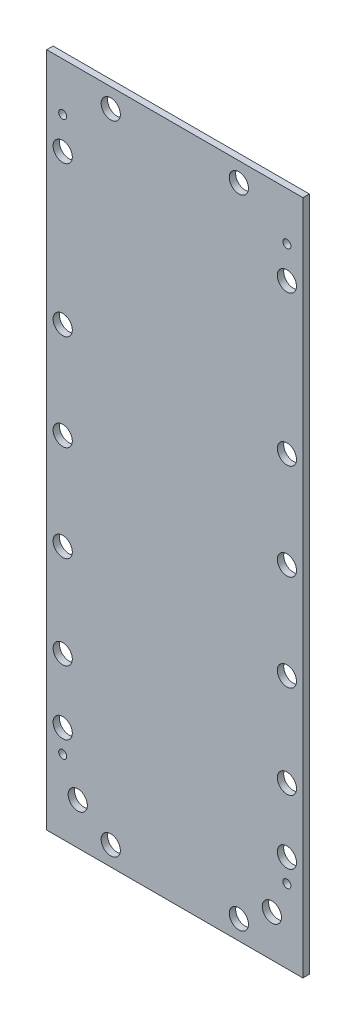
ISO-10303-21;
HEADER;
FILE_DESCRIPTION(('STEP AP214'),'2;1');
FILE_NAME('part.step','',(''),(''),'','','');
FILE_SCHEMA(('AUTOMOTIVE_DESIGN { 1 0 10303 214 1 1 1 1 }'));
ENDSEC;
DATA;
#1=APPLICATION_CONTEXT('core data for automotive mechanical design processes');
#2=APPLICATION_PROTOCOL_DEFINITION('international standard','automotive_design',2000,#1);
#3=PRODUCT_CONTEXT('',#1,'mechanical');
#4=PRODUCT('Part','Part','',(#3));
#5=PRODUCT_RELATED_PRODUCT_CATEGORY('part','',(#4));
#6=PRODUCT_DEFINITION_FORMATION('','',#4);
#7=PRODUCT_DEFINITION_CONTEXT('part definition',#1,'design');
#8=PRODUCT_DEFINITION('design','',#6,#7);
#9=PRODUCT_DEFINITION_SHAPE('','',#8);
#10=(LENGTH_UNIT() NAMED_UNIT(*) SI_UNIT(.MILLI.,.METRE.));
#11=(NAMED_UNIT(*) PLANE_ANGLE_UNIT() SI_UNIT($,.RADIAN.));
#12=(NAMED_UNIT(*) SI_UNIT($,.STERADIAN.) SOLID_ANGLE_UNIT());
#13=UNCERTAINTY_MEASURE_WITH_UNIT(LENGTH_MEASURE(1.E-05),#10,'distance_accuracy_value','');
#14=(GEOMETRIC_REPRESENTATION_CONTEXT(3) GLOBAL_UNCERTAINTY_ASSIGNED_CONTEXT((#13)) GLOBAL_UNIT_ASSIGNED_CONTEXT((#10,
#11,#12)) REPRESENTATION_CONTEXT('',''));
#15=CARTESIAN_POINT('',(0.,0.,0.));
#16=DIRECTION('',(0.,0.,1.));
#17=DIRECTION('',(1.,0.,0.));
#18=AXIS2_PLACEMENT_3D('',#15,#16,#17);
#19=CARTESIAN_POINT('',(80.,0.,2.));
#20=DIRECTION('',(0.,1.,0.));
#21=DIRECTION('',(0.,0.,1.));
#22=AXIS2_PLACEMENT_3D('',#19,#20,#21);
#23=PLANE('',#22);
#24=DIRECTION('',(1.,0.,0.));
#25=VECTOR('',#24,1.);
#26=CARTESIAN_POINT('',(80.,0.,0.));
#27=LINE('',#26,#25);
#28=CARTESIAN_POINT('',(0.,0.,0.));
#29=VERTEX_POINT('',#28);
#30=CARTESIAN_POINT('',(80.,0.,0.));
#31=VERTEX_POINT('',#30);
#32=EDGE_CURVE('E104',#29,#31,#27,.T.);
#33=ORIENTED_EDGE('',*,*,#32,.T.);
#34=DIRECTION('',(0.,0.,-1.));
#35=VECTOR('',#34,1.);
#36=CARTESIAN_POINT('',(80.,0.,2.));
#37=LINE('',#36,#35);
#38=CARTESIAN_POINT('',(80.,0.,2.));
#39=VERTEX_POINT('',#38);
#40=EDGE_CURVE('E11',#39,#31,#37,.T.);
#41=ORIENTED_EDGE('',*,*,#40,.F.);
#42=DIRECTION('',(1.,0.,0.));
#43=VECTOR('',#42,1.);
#44=CARTESIAN_POINT('',(80.,0.,2.));
#45=LINE('',#44,#43);
#46=CARTESIAN_POINT('',(0.,0.,2.));
#47=VERTEX_POINT('',#46);
#48=EDGE_CURVE('E91',#47,#39,#45,.T.);
#49=ORIENTED_EDGE('',*,*,#48,.F.);
#50=DIRECTION('',(0.,0.,-1.));
#51=VECTOR('',#50,1.);
#52=CARTESIAN_POINT('',(0.,0.,2.));
#53=LINE('',#52,#51);
#54=EDGE_CURVE('E100',#47,#29,#53,.T.);
#55=ORIENTED_EDGE('',*,*,#54,.T.);
#56=EDGE_LOOP('',(#33,#41,#49,#55));
#57=FACE_BOUND('',#56,.T.);
#58=ADVANCED_FACE('F38',(#57),#23,.F.);
#59=CARTESIAN_POINT('',(80.,211.,2.));
#60=DIRECTION('',(-1.,0.,0.));
#61=DIRECTION('',(0.,0.,1.));
#62=AXIS2_PLACEMENT_3D('',#59,#60,#61);
#63=PLANE('',#62);
#64=DIRECTION('',(0.,1.,0.));
#65=VECTOR('',#64,1.);
#66=CARTESIAN_POINT('',(80.,211.,0.));
#67=LINE('',#66,#65);
#68=CARTESIAN_POINT('',(80.,211.,0.));
#69=VERTEX_POINT('',#68);
#70=EDGE_CURVE('E95',#31,#69,#67,.T.);
#71=ORIENTED_EDGE('',*,*,#70,.T.);
#72=DIRECTION('',(0.,0.,-1.));
#73=VECTOR('',#72,1.);
#74=CARTESIAN_POINT('',(80.,211.,2.));
#75=LINE('',#74,#73);
#76=CARTESIAN_POINT('',(80.,211.,2.));
#77=VERTEX_POINT('',#76);
#78=EDGE_CURVE('E47',#77,#69,#75,.T.);
#79=ORIENTED_EDGE('',*,*,#78,.F.);
#80=DIRECTION('',(0.,1.,0.));
#81=VECTOR('',#80,1.);
#82=CARTESIAN_POINT('',(80.,211.,2.));
#83=LINE('',#82,#81);
#84=EDGE_CURVE('E86',#39,#77,#83,.T.);
#85=ORIENTED_EDGE('',*,*,#84,.F.);
#86=ORIENTED_EDGE('',*,*,#40,.T.);
#87=EDGE_LOOP('',(#71,#79,#85,#86));
#88=FACE_BOUND('',#87,.T.);
#89=ADVANCED_FACE('F94',(#88),#63,.F.);
#90=CARTESIAN_POINT('',(0.,211.,2.));
#91=DIRECTION('',(0.,-1.,0.));
#92=DIRECTION('',(0.,0.,-1.));
#93=AXIS2_PLACEMENT_3D('',#90,#91,#92);
#94=PLANE('',#93);
#95=DIRECTION('',(-1.,0.,0.));
#96=VECTOR('',#95,1.);
#97=CARTESIAN_POINT('',(0.,211.,0.));
#98=LINE('',#97,#96);
#99=CARTESIAN_POINT('',(0.,211.,0.));
#100=VERTEX_POINT('',#99);
#101=EDGE_CURVE('E73',#69,#100,#98,.T.);
#102=ORIENTED_EDGE('',*,*,#101,.T.);
#103=DIRECTION('',(0.,0.,-1.));
#104=VECTOR('',#103,1.);
#105=CARTESIAN_POINT('',(0.,211.,2.));
#106=LINE('',#105,#104);
#107=CARTESIAN_POINT('',(0.,211.,2.));
#108=VERTEX_POINT('',#107);
#109=EDGE_CURVE('E96',#108,#100,#106,.T.);
#110=ORIENTED_EDGE('',*,*,#109,.F.);
#111=DIRECTION('',(-1.,0.,0.));
#112=VECTOR('',#111,1.);
#113=CARTESIAN_POINT('',(0.,211.,2.));
#114=LINE('',#113,#112);
#115=EDGE_CURVE('E89',#77,#108,#114,.T.);
#116=ORIENTED_EDGE('',*,*,#115,.F.);
#117=ORIENTED_EDGE('',*,*,#78,.T.);
#118=EDGE_LOOP('',(#102,#110,#116,#117));
#119=FACE_BOUND('',#118,.T.);
#120=ADVANCED_FACE('F98',(#119),#94,.F.);
#121=CARTESIAN_POINT('',(0.,0.,2.));
#122=DIRECTION('',(1.,0.,0.));
#123=DIRECTION('',(0.,0.,-1.));
#124=AXIS2_PLACEMENT_3D('',#121,#122,#123);
#125=PLANE('',#124);
#126=DIRECTION('',(0.,-1.,0.));
#127=VECTOR('',#126,1.);
#128=CARTESIAN_POINT('',(0.,0.,0.));
#129=LINE('',#128,#127);
#130=EDGE_CURVE('E79',#100,#29,#129,.T.);
#131=ORIENTED_EDGE('',*,*,#130,.T.);
#132=ORIENTED_EDGE('',*,*,#54,.F.);
#133=DIRECTION('',(0.,-1.,0.));
#134=VECTOR('',#133,1.);
#135=CARTESIAN_POINT('',(0.,0.,2.));
#136=LINE('',#135,#134);
#137=EDGE_CURVE('E56',#108,#47,#136,.T.);
#138=ORIENTED_EDGE('',*,*,#137,.F.);
#139=ORIENTED_EDGE('',*,*,#109,.T.);
#140=EDGE_LOOP('',(#131,#132,#138,#139));
#141=FACE_BOUND('',#140,.T.);
#142=ADVANCED_FACE('F156',(#141),#125,.F.);
#143=CARTESIAN_POINT('',(0.,0.,2.));
#144=DIRECTION('',(0.,0.,-1.));
#145=DIRECTION('',(-1.,0.,0.));
#146=AXIS2_PLACEMENT_3D('',#143,#144,#145);
#147=PLANE('',#146);
#148=CARTESIAN_POINT('',(20.,205.,2.));
#149=DIRECTION('',(0.,0.,-1.));
#150=DIRECTION('',(-1.,0.,0.));
#151=AXIS2_PLACEMENT_3D('',#148,#149,#150);
#152=CIRCLE('',#151,3.);
#153=CARTESIAN_POINT('',(17.,205.,2.));
#154=VERTEX_POINT('',#153);
#155=EDGE_CURVE('E407',#154,#154,#152,.F.);
#156=ORIENTED_EDGE('',*,*,#155,.F.);
#157=EDGE_LOOP('',(#156));
#158=FACE_BOUND('',#157,.T.);
#159=CARTESIAN_POINT('',(5.00000000000001,30.2,2.));
#160=DIRECTION('',(0.,0.,-1.));
#161=DIRECTION('',(-1.,0.,0.));
#162=AXIS2_PLACEMENT_3D('',#159,#160,#161);
#163=CIRCLE('',#162,3.);
#164=CARTESIAN_POINT('',(2.00000000000001,30.2,2.));
#165=VERTEX_POINT('',#164);
#166=EDGE_CURVE('E419',#165,#165,#163,.F.);
#167=ORIENTED_EDGE('',*,*,#166,.F.);
#168=EDGE_LOOP('',(#167));
#169=FACE_BOUND('',#168,.T.);
#170=CARTESIAN_POINT('',(5.00000000000001,50.2,2.));
#171=DIRECTION('',(0.,0.,-1.));
#172=DIRECTION('',(-1.,0.,0.));
#173=AXIS2_PLACEMENT_3D('',#170,#171,#172);
#174=CIRCLE('',#173,3.);
#175=CARTESIAN_POINT('',(2.00000000000001,50.2,2.));
#176=VERTEX_POINT('',#175);
#177=EDGE_CURVE('E426',#176,#176,#174,.F.);
#178=ORIENTED_EDGE('',*,*,#177,.F.);
#179=EDGE_LOOP('',(#178));
#180=FACE_BOUND('',#179,.T.);
#181=CARTESIAN_POINT('',(5.00000000000002,79.2,2.));
#182=DIRECTION('',(0.,0.,-1.));
#183=DIRECTION('',(-1.,0.,0.));
#184=AXIS2_PLACEMENT_3D('',#181,#182,#183);
#185=CIRCLE('',#184,3.);
#186=CARTESIAN_POINT('',(2.00000000000001,79.2,2.));
#187=VERTEX_POINT('',#186);
#188=EDGE_CURVE('E425',#187,#187,#185,.F.);
#189=ORIENTED_EDGE('',*,*,#188,.F.);
#190=EDGE_LOOP('',(#189));
#191=FACE_BOUND('',#190,.T.);
#192=CARTESIAN_POINT('',(60.,5.99999999999999,2.));
#193=DIRECTION('',(0.,0.,-1.));
#194=DIRECTION('',(-1.,0.,0.));
#195=AXIS2_PLACEMENT_3D('',#192,#193,#194);
#196=CIRCLE('',#195,3.);
#197=CARTESIAN_POINT('',(57.,5.99999999999999,2.));
#198=VERTEX_POINT('',#197);
#199=EDGE_CURVE('E411',#198,#198,#196,.F.);
#200=ORIENTED_EDGE('',*,*,#199,.F.);
#201=EDGE_LOOP('',(#200));
#202=FACE_BOUND('',#201,.T.);
#203=CARTESIAN_POINT('',(20.,5.99999999999999,2.));
#204=DIRECTION('',(0.,0.,-1.));
#205=DIRECTION('',(-1.,0.,0.));
#206=AXIS2_PLACEMENT_3D('',#203,#204,#205);
#207=CIRCLE('',#206,2.99999999999999);
#208=CARTESIAN_POINT('',(17.,5.99999999999999,2.));
#209=VERTEX_POINT('',#208);
#210=EDGE_CURVE('E535',#209,#209,#207,.F.);
#211=ORIENTED_EDGE('',*,*,#210,.F.);
#212=EDGE_LOOP('',(#211));
#213=FACE_BOUND('',#212,.T.);
#214=CARTESIAN_POINT('',(70.3,13.,2.));
#215=DIRECTION('',(0.,0.,-1.));
#216=DIRECTION('',(-1.,0.,0.));
#217=AXIS2_PLACEMENT_3D('',#214,#215,#216);
#218=CIRCLE('',#217,3.00000000000001);
#219=CARTESIAN_POINT('',(67.3,13.,2.));
#220=VERTEX_POINT('',#219);
#221=EDGE_CURVE('E540',#220,#220,#218,.F.);
#222=ORIENTED_EDGE('',*,*,#221,.F.);
#223=EDGE_LOOP('',(#222));
#224=FACE_BOUND('',#223,.T.);
#225=CARTESIAN_POINT('',(60.,205.,2.));
#226=DIRECTION('',(0.,0.,-1.));
#227=DIRECTION('',(-1.,0.,0.));
#228=AXIS2_PLACEMENT_3D('',#225,#226,#227);
#229=CIRCLE('',#228,3.);
#230=CARTESIAN_POINT('',(57.,205.,2.));
#231=VERTEX_POINT('',#230);
#232=EDGE_CURVE('E529',#231,#231,#229,.F.);
#233=ORIENTED_EDGE('',*,*,#232,.F.);
#234=EDGE_LOOP('',(#233));
#235=FACE_BOUND('',#234,.T.);
#236=CARTESIAN_POINT('',(75.,139.2,2.));
#237=DIRECTION('',(0.,0.,-1.));
#238=DIRECTION('',(-1.,0.,0.));
#239=AXIS2_PLACEMENT_3D('',#236,#237,#238);
#240=CIRCLE('',#239,3.00000000000001);
#241=CARTESIAN_POINT('',(72.,139.2,2.));
#242=VERTEX_POINT('',#241);
#243=EDGE_CURVE('E462',#242,#242,#240,.F.);
#244=ORIENTED_EDGE('',*,*,#243,.F.);
#245=EDGE_LOOP('',(#244));
#246=FACE_BOUND('',#245,.T.);
#247=CARTESIAN_POINT('',(75.,109.2,2.));
#248=DIRECTION('',(0.,0.,-1.));
#249=DIRECTION('',(-1.,0.,0.));
#250=AXIS2_PLACEMENT_3D('',#247,#248,#249);
#251=CIRCLE('',#250,3.00000000000001);
#252=CARTESIAN_POINT('',(72.,109.2,2.));
#253=VERTEX_POINT('',#252);
#254=EDGE_CURVE('E463',#253,#253,#251,.F.);
#255=ORIENTED_EDGE('',*,*,#254,.F.);
#256=EDGE_LOOP('',(#255));
#257=FACE_BOUND('',#256,.T.);
#258=CARTESIAN_POINT('',(75.,79.2,2.));
#259=DIRECTION('',(0.,0.,-1.));
#260=DIRECTION('',(-1.,0.,0.));
#261=AXIS2_PLACEMENT_3D('',#258,#259,#260);
#262=CIRCLE('',#261,3.00000000000001);
#263=CARTESIAN_POINT('',(72.,79.2,2.));
#264=VERTEX_POINT('',#263);
#265=EDGE_CURVE('E470',#264,#264,#262,.F.);
#266=ORIENTED_EDGE('',*,*,#265,.F.);
#267=EDGE_LOOP('',(#266));
#268=FACE_BOUND('',#267,.T.);
#269=CARTESIAN_POINT('',(75.,50.2,2.));
#270=DIRECTION('',(0.,0.,-1.));
#271=DIRECTION('',(-1.,0.,0.));
#272=AXIS2_PLACEMENT_3D('',#269,#270,#271);
#273=CIRCLE('',#272,3.00000000000001);
#274=CARTESIAN_POINT('',(72.,50.2,2.));
#275=VERTEX_POINT('',#274);
#276=EDGE_CURVE('E476',#275,#275,#273,.F.);
#277=ORIENTED_EDGE('',*,*,#276,.F.);
#278=EDGE_LOOP('',(#277));
#279=FACE_BOUND('',#278,.T.);
#280=CARTESIAN_POINT('',(5.00000000000002,109.2,2.));
#281=DIRECTION('',(0.,0.,-1.));
#282=DIRECTION('',(-1.,0.,0.));
#283=AXIS2_PLACEMENT_3D('',#280,#281,#282);
#284=CIRCLE('',#283,3.);
#285=CARTESIAN_POINT('',(2.00000000000002,109.2,2.));
#286=VERTEX_POINT('',#285);
#287=EDGE_CURVE('E439',#286,#286,#284,.F.);
#288=ORIENTED_EDGE('',*,*,#287,.F.);
#289=EDGE_LOOP('',(#288));
#290=FACE_BOUND('',#289,.T.);
#291=CARTESIAN_POINT('',(5.00000000000002,139.2,2.));
#292=DIRECTION('',(0.,0.,-1.));
#293=DIRECTION('',(-1.,0.,0.));
#294=AXIS2_PLACEMENT_3D('',#291,#292,#293);
#295=CIRCLE('',#294,3.);
#296=CARTESIAN_POINT('',(2.00000000000002,139.2,2.));
#297=VERTEX_POINT('',#296);
#298=EDGE_CURVE('E438',#297,#297,#295,.F.);
#299=ORIENTED_EDGE('',*,*,#298,.F.);
#300=EDGE_LOOP('',(#299));
#301=FACE_BOUND('',#300,.T.);
#302=CARTESIAN_POINT('',(5.00000000000003,186.,2.));
#303=DIRECTION('',(0.,0.,-1.));
#304=DIRECTION('',(-1.,0.,0.));
#305=AXIS2_PLACEMENT_3D('',#302,#303,#304);
#306=CIRCLE('',#305,3.);
#307=CARTESIAN_POINT('',(2.00000000000003,186.,2.));
#308=VERTEX_POINT('',#307);
#309=EDGE_CURVE('E451',#308,#308,#306,.F.);
#310=ORIENTED_EDGE('',*,*,#309,.F.);
#311=EDGE_LOOP('',(#310));
#312=FACE_BOUND('',#311,.T.);
#313=CARTESIAN_POINT('',(75.,30.2,2.));
#314=DIRECTION('',(0.,0.,-1.));
#315=DIRECTION('',(-1.,0.,0.));
#316=AXIS2_PLACEMENT_3D('',#313,#314,#315);
#317=CIRCLE('',#316,3.00000000000001);
#318=CARTESIAN_POINT('',(72.,30.2,2.));
#319=VERTEX_POINT('',#318);
#320=EDGE_CURVE('E450',#319,#319,#317,.F.);
#321=ORIENTED_EDGE('',*,*,#320,.F.);
#322=EDGE_LOOP('',(#321));
#323=FACE_BOUND('',#322,.T.);
#324=CARTESIAN_POINT('',(9.7,13.,2.));
#325=DIRECTION('',(0.,0.,-1.));
#326=DIRECTION('',(-1.,0.,0.));
#327=AXIS2_PLACEMENT_3D('',#324,#325,#326);
#328=CIRCLE('',#327,3.);
#329=CARTESIAN_POINT('',(6.7,13.,2.));
#330=VERTEX_POINT('',#329);
#331=EDGE_CURVE('E524',#330,#330,#328,.F.);
#332=ORIENTED_EDGE('',*,*,#331,.F.);
#333=EDGE_LOOP('',(#332));
#334=FACE_BOUND('',#333,.T.);
#335=CARTESIAN_POINT('',(75.,186.,2.));
#336=DIRECTION('',(0.,0.,-1.));
#337=DIRECTION('',(-1.,0.,0.));
#338=AXIS2_PLACEMENT_3D('',#335,#336,#337);
#339=CIRCLE('',#338,3.00000000000001);
#340=CARTESIAN_POINT('',(72.,186.,2.));
#341=VERTEX_POINT('',#340);
#342=EDGE_CURVE('E485',#341,#341,#339,.F.);
#343=ORIENTED_EDGE('',*,*,#342,.F.);
#344=EDGE_LOOP('',(#343));
#345=FACE_BOUND('',#344,.T.);
#346=CARTESIAN_POINT('',(75.,196.,2.));
#347=DIRECTION('',(0.,0.,-1.));
#348=DIRECTION('',(-1.,0.,0.));
#349=AXIS2_PLACEMENT_3D('',#346,#347,#348);
#350=CIRCLE('',#349,1.25);
#351=CARTESIAN_POINT('',(73.75,196.,2.));
#352=VERTEX_POINT('',#351);
#353=EDGE_CURVE('E41',#352,#352,#350,.T.);
#354=ORIENTED_EDGE('',*,*,#353,.T.);
#355=EDGE_LOOP('',(#354));
#356=FACE_BOUND('',#355,.T.);
#357=CARTESIAN_POINT('',(5.00000000000003,196.,2.));
#358=DIRECTION('',(0.,0.,-1.));
#359=DIRECTION('',(-1.,0.,0.));
#360=AXIS2_PLACEMENT_3D('',#357,#358,#359);
#361=CIRCLE('',#360,1.25);
#362=CARTESIAN_POINT('',(3.75000000000003,196.,2.));
#363=VERTEX_POINT('',#362);
#364=EDGE_CURVE('E121',#363,#363,#361,.T.);
#365=ORIENTED_EDGE('',*,*,#364,.T.);
#366=EDGE_LOOP('',(#365));
#367=FACE_BOUND('',#366,.T.);
#368=CARTESIAN_POINT('',(75.,23.,2.));
#369=DIRECTION('',(0.,0.,-1.));
#370=DIRECTION('',(-1.,0.,0.));
#371=AXIS2_PLACEMENT_3D('',#368,#369,#370);
#372=CIRCLE('',#371,1.25);
#373=CARTESIAN_POINT('',(73.75,23.,2.));
#374=VERTEX_POINT('',#373);
#375=EDGE_CURVE('E112',#374,#374,#372,.T.);
#376=ORIENTED_EDGE('',*,*,#375,.T.);
#377=EDGE_LOOP('',(#376));
#378=FACE_BOUND('',#377,.T.);
#379=CARTESIAN_POINT('',(5.00000000000003,23.,2.));
#380=DIRECTION('',(0.,0.,-1.));
#381=DIRECTION('',(-1.,0.,0.));
#382=AXIS2_PLACEMENT_3D('',#379,#380,#381);
#383=CIRCLE('',#382,1.25);
#384=CARTESIAN_POINT('',(3.75000000000003,23.,2.));
#385=VERTEX_POINT('',#384);
#386=EDGE_CURVE('E107',#385,#385,#383,.T.);
#387=ORIENTED_EDGE('',*,*,#386,.T.);
#388=EDGE_LOOP('',(#387));
#389=FACE_BOUND('',#388,.T.);
#390=ORIENTED_EDGE('',*,*,#48,.T.);
#391=ORIENTED_EDGE('',*,*,#84,.T.);
#392=ORIENTED_EDGE('',*,*,#115,.T.);
#393=ORIENTED_EDGE('',*,*,#137,.T.);
#394=EDGE_LOOP('',(#390,#391,#392,#393));
#395=FACE_BOUND('',#394,.T.);
#396=ADVANCED_FACE('F87',(#158,#169,#180,#191,#202,#213,#224,#235,#246,#257,#268,#279,#290,#301,
#312,#323,#334,#345,#356,#367,#378,#389,#395),#147,.F.);
#397=CARTESIAN_POINT('',(0.,0.,0.));
#398=DIRECTION('',(0.,0.,-1.));
#399=DIRECTION('',(-1.,0.,0.));
#400=AXIS2_PLACEMENT_3D('',#397,#398,#399);
#401=PLANE('',#400);
#402=CARTESIAN_POINT('',(20.,205.,0.));
#403=DIRECTION('',(0.,0.,-1.));
#404=DIRECTION('',(-1.,0.,0.));
#405=AXIS2_PLACEMENT_3D('',#402,#403,#404);
#406=CIRCLE('',#405,3.);
#407=CARTESIAN_POINT('',(17.,205.,0.));
#408=VERTEX_POINT('',#407);
#409=EDGE_CURVE('E410',#408,#408,#406,.T.);
#410=ORIENTED_EDGE('',*,*,#409,.F.);
#411=EDGE_LOOP('',(#410));
#412=FACE_BOUND('',#411,.T.);
#413=CARTESIAN_POINT('',(5.00000000000001,30.2,0.));
#414=DIRECTION('',(0.,0.,-1.));
#415=DIRECTION('',(-1.,0.,0.));
#416=AXIS2_PLACEMENT_3D('',#413,#414,#415);
#417=CIRCLE('',#416,3.);
#418=CARTESIAN_POINT('',(2.00000000000001,30.2,0.));
#419=VERTEX_POINT('',#418);
#420=EDGE_CURVE('E413',#419,#419,#417,.T.);
#421=ORIENTED_EDGE('',*,*,#420,.F.);
#422=EDGE_LOOP('',(#421));
#423=FACE_BOUND('',#422,.T.);
#424=CARTESIAN_POINT('',(5.00000000000001,50.2,0.));
#425=DIRECTION('',(0.,0.,-1.));
#426=DIRECTION('',(-1.,0.,0.));
#427=AXIS2_PLACEMENT_3D('',#424,#425,#426);
#428=CIRCLE('',#427,3.);
#429=CARTESIAN_POINT('',(2.00000000000001,50.2,0.));
#430=VERTEX_POINT('',#429);
#431=EDGE_CURVE('E430',#430,#430,#428,.T.);
#432=ORIENTED_EDGE('',*,*,#431,.F.);
#433=EDGE_LOOP('',(#432));
#434=FACE_BOUND('',#433,.T.);
#435=CARTESIAN_POINT('',(5.00000000000002,79.2,0.));
#436=DIRECTION('',(0.,0.,-1.));
#437=DIRECTION('',(-1.,0.,0.));
#438=AXIS2_PLACEMENT_3D('',#435,#436,#437);
#439=CIRCLE('',#438,3.);
#440=CARTESIAN_POINT('',(2.00000000000001,79.2,0.));
#441=VERTEX_POINT('',#440);
#442=EDGE_CURVE('E422',#441,#441,#439,.T.);
#443=ORIENTED_EDGE('',*,*,#442,.F.);
#444=EDGE_LOOP('',(#443));
#445=FACE_BOUND('',#444,.T.);
#446=CARTESIAN_POINT('',(60.,5.99999999999999,0.));
#447=DIRECTION('',(0.,0.,-1.));
#448=DIRECTION('',(-1.,0.,0.));
#449=AXIS2_PLACEMENT_3D('',#446,#447,#448);
#450=CIRCLE('',#449,3.);
#451=CARTESIAN_POINT('',(57.,5.99999999999999,0.));
#452=VERTEX_POINT('',#451);
#453=EDGE_CURVE('E416',#452,#452,#450,.T.);
#454=ORIENTED_EDGE('',*,*,#453,.F.);
#455=EDGE_LOOP('',(#454));
#456=FACE_BOUND('',#455,.T.);
#457=CARTESIAN_POINT('',(20.,5.99999999999999,0.));
#458=DIRECTION('',(0.,0.,-1.));
#459=DIRECTION('',(-1.,0.,0.));
#460=AXIS2_PLACEMENT_3D('',#457,#458,#459);
#461=CIRCLE('',#460,2.99999999999999);
#462=CARTESIAN_POINT('',(17.,5.99999999999999,0.));
#463=VERTEX_POINT('',#462);
#464=EDGE_CURVE('E537',#463,#463,#461,.T.);
#465=ORIENTED_EDGE('',*,*,#464,.F.);
#466=EDGE_LOOP('',(#465));
#467=FACE_BOUND('',#466,.T.);
#468=CARTESIAN_POINT('',(70.3,13.,0.));
#469=DIRECTION('',(0.,0.,-1.));
#470=DIRECTION('',(-1.,0.,0.));
#471=AXIS2_PLACEMENT_3D('',#468,#469,#470);
#472=CIRCLE('',#471,3.00000000000001);
#473=CARTESIAN_POINT('',(67.3,13.,0.));
#474=VERTEX_POINT('',#473);
#475=EDGE_CURVE('E543',#474,#474,#472,.T.);
#476=ORIENTED_EDGE('',*,*,#475,.F.);
#477=EDGE_LOOP('',(#476));
#478=FACE_BOUND('',#477,.T.);
#479=CARTESIAN_POINT('',(60.,205.,0.));
#480=DIRECTION('',(0.,0.,-1.));
#481=DIRECTION('',(-1.,0.,0.));
#482=AXIS2_PLACEMENT_3D('',#479,#480,#481);
#483=CIRCLE('',#482,3.);
#484=CARTESIAN_POINT('',(57.,205.,0.));
#485=VERTEX_POINT('',#484);
#486=EDGE_CURVE('E525',#485,#485,#483,.T.);
#487=ORIENTED_EDGE('',*,*,#486,.F.);
#488=EDGE_LOOP('',(#487));
#489=FACE_BOUND('',#488,.T.);
#490=CARTESIAN_POINT('',(75.,139.2,0.));
#491=DIRECTION('',(0.,0.,-1.));
#492=DIRECTION('',(-1.,0.,0.));
#493=AXIS2_PLACEMENT_3D('',#490,#491,#492);
#494=CIRCLE('',#493,3.00000000000001);
#495=CARTESIAN_POINT('',(72.,139.2,0.));
#496=VERTEX_POINT('',#495);
#497=EDGE_CURVE('E459',#496,#496,#494,.T.);
#498=ORIENTED_EDGE('',*,*,#497,.F.);
#499=EDGE_LOOP('',(#498));
#500=FACE_BOUND('',#499,.T.);
#501=CARTESIAN_POINT('',(75.,109.2,0.));
#502=DIRECTION('',(0.,0.,-1.));
#503=DIRECTION('',(-1.,0.,0.));
#504=AXIS2_PLACEMENT_3D('',#501,#502,#503);
#505=CIRCLE('',#504,3.00000000000001);
#506=CARTESIAN_POINT('',(72.,109.2,0.));
#507=VERTEX_POINT('',#506);
#508=EDGE_CURVE('E467',#507,#507,#505,.T.);
#509=ORIENTED_EDGE('',*,*,#508,.F.);
#510=EDGE_LOOP('',(#509));
#511=FACE_BOUND('',#510,.T.);
#512=CARTESIAN_POINT('',(75.,79.2,0.));
#513=DIRECTION('',(0.,0.,-1.));
#514=DIRECTION('',(-1.,0.,0.));
#515=AXIS2_PLACEMENT_3D('',#512,#513,#514);
#516=CIRCLE('',#515,3.00000000000001);
#517=CARTESIAN_POINT('',(72.,79.2,0.));
#518=VERTEX_POINT('',#517);
#519=EDGE_CURVE('E473',#518,#518,#516,.T.);
#520=ORIENTED_EDGE('',*,*,#519,.F.);
#521=EDGE_LOOP('',(#520));
#522=FACE_BOUND('',#521,.T.);
#523=CARTESIAN_POINT('',(75.,50.2,0.));
#524=DIRECTION('',(0.,0.,-1.));
#525=DIRECTION('',(-1.,0.,0.));
#526=AXIS2_PLACEMENT_3D('',#523,#524,#525);
#527=CIRCLE('',#526,3.00000000000001);
#528=CARTESIAN_POINT('',(72.,50.2,0.));
#529=VERTEX_POINT('',#528);
#530=EDGE_CURVE('E454',#529,#529,#527,.T.);
#531=ORIENTED_EDGE('',*,*,#530,.F.);
#532=EDGE_LOOP('',(#531));
#533=FACE_BOUND('',#532,.T.);
#534=CARTESIAN_POINT('',(5.00000000000002,109.2,0.));
#535=DIRECTION('',(0.,0.,-1.));
#536=DIRECTION('',(-1.,0.,0.));
#537=AXIS2_PLACEMENT_3D('',#534,#535,#536);
#538=CIRCLE('',#537,3.);
#539=CARTESIAN_POINT('',(2.00000000000002,109.2,0.));
#540=VERTEX_POINT('',#539);
#541=EDGE_CURVE('E429',#540,#540,#538,.T.);
#542=ORIENTED_EDGE('',*,*,#541,.F.);
#543=EDGE_LOOP('',(#542));
#544=FACE_BOUND('',#543,.T.);
#545=CARTESIAN_POINT('',(5.00000000000002,139.2,0.));
#546=DIRECTION('',(0.,0.,-1.));
#547=DIRECTION('',(-1.,0.,0.));
#548=AXIS2_PLACEMENT_3D('',#545,#546,#547);
#549=CIRCLE('',#548,3.);
#550=CARTESIAN_POINT('',(2.00000000000002,139.2,0.));
#551=VERTEX_POINT('',#550);
#552=EDGE_CURVE('E435',#551,#551,#549,.T.);
#553=ORIENTED_EDGE('',*,*,#552,.F.);
#554=EDGE_LOOP('',(#553));
#555=FACE_BOUND('',#554,.T.);
#556=CARTESIAN_POINT('',(5.00000000000003,186.,0.));
#557=DIRECTION('',(0.,0.,-1.));
#558=DIRECTION('',(-1.,0.,0.));
#559=AXIS2_PLACEMENT_3D('',#556,#557,#558);
#560=CIRCLE('',#559,3.);
#561=CARTESIAN_POINT('',(2.00000000000003,186.,0.));
#562=VERTEX_POINT('',#561);
#563=EDGE_CURVE('E442',#562,#562,#560,.T.);
#564=ORIENTED_EDGE('',*,*,#563,.F.);
#565=EDGE_LOOP('',(#564));
#566=FACE_BOUND('',#565,.T.);
#567=CARTESIAN_POINT('',(75.,30.2,0.));
#568=DIRECTION('',(0.,0.,-1.));
#569=DIRECTION('',(-1.,0.,0.));
#570=AXIS2_PLACEMENT_3D('',#567,#568,#569);
#571=CIRCLE('',#570,3.00000000000001);
#572=CARTESIAN_POINT('',(72.,30.2,0.));
#573=VERTEX_POINT('',#572);
#574=EDGE_CURVE('E447',#573,#573,#571,.T.);
#575=ORIENTED_EDGE('',*,*,#574,.F.);
#576=EDGE_LOOP('',(#575));
#577=FACE_BOUND('',#576,.T.);
#578=CARTESIAN_POINT('',(9.7,13.,0.));
#579=DIRECTION('',(0.,0.,-1.));
#580=DIRECTION('',(-1.,0.,0.));
#581=AXIS2_PLACEMENT_3D('',#578,#579,#580);
#582=CIRCLE('',#581,3.);
#583=CARTESIAN_POINT('',(6.7,13.,0.));
#584=VERTEX_POINT('',#583);
#585=EDGE_CURVE('E526',#584,#584,#582,.T.);
#586=ORIENTED_EDGE('',*,*,#585,.F.);
#587=EDGE_LOOP('',(#586));
#588=FACE_BOUND('',#587,.T.);
#589=CARTESIAN_POINT('',(75.,186.,0.));
#590=DIRECTION('',(0.,0.,-1.));
#591=DIRECTION('',(-1.,0.,0.));
#592=AXIS2_PLACEMENT_3D('',#589,#590,#591);
#593=CIRCLE('',#592,3.00000000000001);
#594=CARTESIAN_POINT('',(72.,186.,0.));
#595=VERTEX_POINT('',#594);
#596=EDGE_CURVE('E466',#595,#595,#593,.T.);
#597=ORIENTED_EDGE('',*,*,#596,.F.);
#598=EDGE_LOOP('',(#597));
#599=FACE_BOUND('',#598,.T.);
#600=CARTESIAN_POINT('',(75.,196.,0.));
#601=DIRECTION('',(0.,0.,-1.));
#602=DIRECTION('',(-1.,0.,0.));
#603=AXIS2_PLACEMENT_3D('',#600,#601,#602);
#604=CIRCLE('',#603,1.25);
#605=CARTESIAN_POINT('',(73.75,196.,0.));
#606=VERTEX_POINT('',#605);
#607=EDGE_CURVE('E488',#606,#606,#604,.T.);
#608=ORIENTED_EDGE('',*,*,#607,.F.);
#609=EDGE_LOOP('',(#608));
#610=FACE_BOUND('',#609,.T.);
#611=CARTESIAN_POINT('',(5.00000000000003,196.,0.));
#612=DIRECTION('',(0.,0.,-1.));
#613=DIRECTION('',(-1.,0.,0.));
#614=AXIS2_PLACEMENT_3D('',#611,#612,#613);
#615=CIRCLE('',#614,1.25);
#616=CARTESIAN_POINT('',(3.75000000000003,196.,0.));
#617=VERTEX_POINT('',#616);
#618=EDGE_CURVE('E126',#617,#617,#615,.T.);
#619=ORIENTED_EDGE('',*,*,#618,.F.);
#620=EDGE_LOOP('',(#619));
#621=FACE_BOUND('',#620,.T.);
#622=CARTESIAN_POINT('',(75.,23.,0.));
#623=DIRECTION('',(0.,0.,-1.));
#624=DIRECTION('',(-1.,0.,0.));
#625=AXIS2_PLACEMENT_3D('',#622,#623,#624);
#626=CIRCLE('',#625,1.25);
#627=CARTESIAN_POINT('',(73.75,23.,0.));
#628=VERTEX_POINT('',#627);
#629=EDGE_CURVE('E115',#628,#628,#626,.T.);
#630=ORIENTED_EDGE('',*,*,#629,.F.);
#631=EDGE_LOOP('',(#630));
#632=FACE_BOUND('',#631,.T.);
#633=CARTESIAN_POINT('',(5.00000000000003,23.,0.));
#634=DIRECTION('',(0.,0.,-1.));
#635=DIRECTION('',(-1.,0.,0.));
#636=AXIS2_PLACEMENT_3D('',#633,#634,#635);
#637=CIRCLE('',#636,1.25);
#638=CARTESIAN_POINT('',(3.75000000000003,23.,0.));
#639=VERTEX_POINT('',#638);
#640=EDGE_CURVE('E114',#639,#639,#637,.T.);
#641=ORIENTED_EDGE('',*,*,#640,.F.);
#642=EDGE_LOOP('',(#641));
#643=FACE_BOUND('',#642,.T.);
#644=ORIENTED_EDGE('',*,*,#32,.F.);
#645=ORIENTED_EDGE('',*,*,#130,.F.);
#646=ORIENTED_EDGE('',*,*,#101,.F.);
#647=ORIENTED_EDGE('',*,*,#70,.F.);
#648=EDGE_LOOP('',(#644,#645,#646,#647));
#649=FACE_BOUND('',#648,.T.);
#650=ADVANCED_FACE('F137',(#412,#423,#434,#445,#456,#467,#478,#489,#500,#511,#522,#533,#544,
#555,#566,#577,#588,#599,#610,#621,#632,#643,#649),#401,.T.);
#651=CARTESIAN_POINT('',(5.00000000000003,23.,0.));
#652=DIRECTION('',(0.,0.,-1.));
#653=DIRECTION('',(-1.,0.,0.));
#654=AXIS2_PLACEMENT_3D('',#651,#652,#653);
#655=CYLINDRICAL_SURFACE('',#654,1.25);
#656=ORIENTED_EDGE('',*,*,#640,.T.);
#657=EDGE_LOOP('',(#656));
#658=FACE_BOUND('',#657,.T.);
#659=ORIENTED_EDGE('',*,*,#386,.F.);
#660=EDGE_LOOP('',(#659));
#661=FACE_BOUND('',#660,.T.);
#662=ADVANCED_FACE('F134',(#658,#661),#655,.F.);
#663=CARTESIAN_POINT('',(75.,23.,0.));
#664=DIRECTION('',(0.,0.,-1.));
#665=DIRECTION('',(-1.,0.,0.));
#666=AXIS2_PLACEMENT_3D('',#663,#664,#665);
#667=CYLINDRICAL_SURFACE('',#666,1.25);
#668=ORIENTED_EDGE('',*,*,#629,.T.);
#669=EDGE_LOOP('',(#668));
#670=FACE_BOUND('',#669,.T.);
#671=ORIENTED_EDGE('',*,*,#375,.F.);
#672=EDGE_LOOP('',(#671));
#673=FACE_BOUND('',#672,.T.);
#674=ADVANCED_FACE('F136',(#670,#673),#667,.F.);
#675=CARTESIAN_POINT('',(5.00000000000003,196.,0.));
#676=DIRECTION('',(0.,0.,-1.));
#677=DIRECTION('',(-1.,0.,0.));
#678=AXIS2_PLACEMENT_3D('',#675,#676,#677);
#679=CYLINDRICAL_SURFACE('',#678,1.25);
#680=ORIENTED_EDGE('',*,*,#618,.T.);
#681=EDGE_LOOP('',(#680));
#682=FACE_BOUND('',#681,.T.);
#683=ORIENTED_EDGE('',*,*,#364,.F.);
#684=EDGE_LOOP('',(#683));
#685=FACE_BOUND('',#684,.T.);
#686=ADVANCED_FACE('F144',(#682,#685),#679,.F.);
#687=CARTESIAN_POINT('',(75.,196.,0.));
#688=DIRECTION('',(0.,0.,-1.));
#689=DIRECTION('',(-1.,0.,0.));
#690=AXIS2_PLACEMENT_3D('',#687,#688,#689);
#691=CYLINDRICAL_SURFACE('',#690,1.25);
#692=ORIENTED_EDGE('',*,*,#607,.T.);
#693=EDGE_LOOP('',(#692));
#694=FACE_BOUND('',#693,.T.);
#695=ORIENTED_EDGE('',*,*,#353,.F.);
#696=EDGE_LOOP('',(#695));
#697=FACE_BOUND('',#696,.T.);
#698=ADVANCED_FACE('F212',(#694,#697),#691,.F.);
#699=CARTESIAN_POINT('',(75.,186.,10.4852813742386));
#700=DIRECTION('',(0.,0.,-1.));
#701=DIRECTION('',(-1.,0.,0.));
#702=AXIS2_PLACEMENT_3D('',#699,#700,#701);
#703=CYLINDRICAL_SURFACE('',#702,3.00000000000001);
#704=ORIENTED_EDGE('',*,*,#342,.T.);
#705=EDGE_LOOP('',(#704));
#706=FACE_BOUND('',#705,.T.);
#707=ORIENTED_EDGE('',*,*,#596,.T.);
#708=EDGE_LOOP('',(#707));
#709=FACE_BOUND('',#708,.T.);
#710=ADVANCED_FACE('F220',(#706,#709),#703,.F.);
#711=CARTESIAN_POINT('',(9.7,13.,10.4852813742386));
#712=DIRECTION('',(0.,0.,-1.));
#713=DIRECTION('',(-1.,0.,0.));
#714=AXIS2_PLACEMENT_3D('',#711,#712,#713);
#715=CYLINDRICAL_SURFACE('',#714,3.);
#716=ORIENTED_EDGE('',*,*,#331,.T.);
#717=EDGE_LOOP('',(#716));
#718=FACE_BOUND('',#717,.T.);
#719=ORIENTED_EDGE('',*,*,#585,.T.);
#720=EDGE_LOOP('',(#719));
#721=FACE_BOUND('',#720,.T.);
#722=ADVANCED_FACE('F228',(#718,#721),#715,.F.);
#723=CARTESIAN_POINT('',(75.,30.2,10.4852813742386));
#724=DIRECTION('',(0.,0.,-1.));
#725=DIRECTION('',(-1.,0.,0.));
#726=AXIS2_PLACEMENT_3D('',#723,#724,#725);
#727=CYLINDRICAL_SURFACE('',#726,3.00000000000001);
#728=ORIENTED_EDGE('',*,*,#320,.T.);
#729=EDGE_LOOP('',(#728));
#730=FACE_BOUND('',#729,.T.);
#731=ORIENTED_EDGE('',*,*,#574,.T.);
#732=EDGE_LOOP('',(#731));
#733=FACE_BOUND('',#732,.T.);
#734=ADVANCED_FACE('F237',(#730,#733),#727,.F.);
#735=CARTESIAN_POINT('',(5.00000000000003,186.,10.4852813742386));
#736=DIRECTION('',(0.,0.,-1.));
#737=DIRECTION('',(-1.,0.,0.));
#738=AXIS2_PLACEMENT_3D('',#735,#736,#737);
#739=CYLINDRICAL_SURFACE('',#738,3.);
#740=ORIENTED_EDGE('',*,*,#309,.T.);
#741=EDGE_LOOP('',(#740));
#742=FACE_BOUND('',#741,.T.);
#743=ORIENTED_EDGE('',*,*,#563,.T.);
#744=EDGE_LOOP('',(#743));
#745=FACE_BOUND('',#744,.T.);
#746=ADVANCED_FACE('F246',(#742,#745),#739,.F.);
#747=CARTESIAN_POINT('',(5.00000000000002,139.2,10.4852813742386));
#748=DIRECTION('',(0.,0.,-1.));
#749=DIRECTION('',(-1.,0.,0.));
#750=AXIS2_PLACEMENT_3D('',#747,#748,#749);
#751=CYLINDRICAL_SURFACE('',#750,3.);
#752=ORIENTED_EDGE('',*,*,#298,.T.);
#753=EDGE_LOOP('',(#752));
#754=FACE_BOUND('',#753,.T.);
#755=ORIENTED_EDGE('',*,*,#552,.T.);
#756=EDGE_LOOP('',(#755));
#757=FACE_BOUND('',#756,.T.);
#758=ADVANCED_FACE('F255',(#754,#757),#751,.F.);
#759=CARTESIAN_POINT('',(5.00000000000002,109.2,10.4852813742386));
#760=DIRECTION('',(0.,0.,-1.));
#761=DIRECTION('',(-1.,0.,0.));
#762=AXIS2_PLACEMENT_3D('',#759,#760,#761);
#763=CYLINDRICAL_SURFACE('',#762,3.);
#764=ORIENTED_EDGE('',*,*,#287,.T.);
#765=EDGE_LOOP('',(#764));
#766=FACE_BOUND('',#765,.T.);
#767=ORIENTED_EDGE('',*,*,#541,.T.);
#768=EDGE_LOOP('',(#767));
#769=FACE_BOUND('',#768,.T.);
#770=ADVANCED_FACE('F264',(#766,#769),#763,.F.);
#771=CARTESIAN_POINT('',(75.,50.2,10.4852813742386));
#772=DIRECTION('',(0.,0.,-1.));
#773=DIRECTION('',(-1.,0.,0.));
#774=AXIS2_PLACEMENT_3D('',#771,#772,#773);
#775=CYLINDRICAL_SURFACE('',#774,3.00000000000001);
#776=ORIENTED_EDGE('',*,*,#276,.T.);
#777=EDGE_LOOP('',(#776));
#778=FACE_BOUND('',#777,.T.);
#779=ORIENTED_EDGE('',*,*,#530,.T.);
#780=EDGE_LOOP('',(#779));
#781=FACE_BOUND('',#780,.T.);
#782=ADVANCED_FACE('F273',(#778,#781),#775,.F.);
#783=CARTESIAN_POINT('',(75.,79.2,10.4852813742386));
#784=DIRECTION('',(0.,0.,-1.));
#785=DIRECTION('',(-1.,0.,0.));
#786=AXIS2_PLACEMENT_3D('',#783,#784,#785);
#787=CYLINDRICAL_SURFACE('',#786,3.00000000000001);
#788=ORIENTED_EDGE('',*,*,#265,.T.);
#789=EDGE_LOOP('',(#788));
#790=FACE_BOUND('',#789,.T.);
#791=ORIENTED_EDGE('',*,*,#519,.T.);
#792=EDGE_LOOP('',(#791));
#793=FACE_BOUND('',#792,.T.);
#794=ADVANCED_FACE('F282',(#790,#793),#787,.F.);
#795=CARTESIAN_POINT('',(75.,109.2,10.4852813742386));
#796=DIRECTION('',(0.,0.,-1.));
#797=DIRECTION('',(-1.,0.,0.));
#798=AXIS2_PLACEMENT_3D('',#795,#796,#797);
#799=CYLINDRICAL_SURFACE('',#798,3.00000000000001);
#800=ORIENTED_EDGE('',*,*,#254,.T.);
#801=EDGE_LOOP('',(#800));
#802=FACE_BOUND('',#801,.T.);
#803=ORIENTED_EDGE('',*,*,#508,.T.);
#804=EDGE_LOOP('',(#803));
#805=FACE_BOUND('',#804,.T.);
#806=ADVANCED_FACE('F291',(#802,#805),#799,.F.);
#807=CARTESIAN_POINT('',(75.,139.2,10.4852813742386));
#808=DIRECTION('',(0.,0.,-1.));
#809=DIRECTION('',(-1.,0.,0.));
#810=AXIS2_PLACEMENT_3D('',#807,#808,#809);
#811=CYLINDRICAL_SURFACE('',#810,3.00000000000001);
#812=ORIENTED_EDGE('',*,*,#243,.T.);
#813=EDGE_LOOP('',(#812));
#814=FACE_BOUND('',#813,.T.);
#815=ORIENTED_EDGE('',*,*,#497,.T.);
#816=EDGE_LOOP('',(#815));
#817=FACE_BOUND('',#816,.T.);
#818=ADVANCED_FACE('F300',(#814,#817),#811,.F.);
#819=CARTESIAN_POINT('',(60.,205.,10.4852813742386));
#820=DIRECTION('',(0.,0.,-1.));
#821=DIRECTION('',(-1.,0.,0.));
#822=AXIS2_PLACEMENT_3D('',#819,#820,#821);
#823=CYLINDRICAL_SURFACE('',#822,3.);
#824=ORIENTED_EDGE('',*,*,#232,.T.);
#825=EDGE_LOOP('',(#824));
#826=FACE_BOUND('',#825,.T.);
#827=ORIENTED_EDGE('',*,*,#486,.T.);
#828=EDGE_LOOP('',(#827));
#829=FACE_BOUND('',#828,.T.);
#830=ADVANCED_FACE('F309',(#826,#829),#823,.F.);
#831=CARTESIAN_POINT('',(70.3,13.,10.4852813742386));
#832=DIRECTION('',(0.,0.,-1.));
#833=DIRECTION('',(-1.,0.,0.));
#834=AXIS2_PLACEMENT_3D('',#831,#832,#833);
#835=CYLINDRICAL_SURFACE('',#834,3.00000000000001);
#836=ORIENTED_EDGE('',*,*,#221,.T.);
#837=EDGE_LOOP('',(#836));
#838=FACE_BOUND('',#837,.T.);
#839=ORIENTED_EDGE('',*,*,#475,.T.);
#840=EDGE_LOOP('',(#839));
#841=FACE_BOUND('',#840,.T.);
#842=ADVANCED_FACE('F318',(#838,#841),#835,.F.);
#843=CARTESIAN_POINT('',(20.,5.99999999999999,10.4852813742386));
#844=DIRECTION('',(0.,0.,-1.));
#845=DIRECTION('',(-1.,0.,0.));
#846=AXIS2_PLACEMENT_3D('',#843,#844,#845);
#847=CYLINDRICAL_SURFACE('',#846,2.99999999999999);
#848=ORIENTED_EDGE('',*,*,#210,.T.);
#849=EDGE_LOOP('',(#848));
#850=FACE_BOUND('',#849,.T.);
#851=ORIENTED_EDGE('',*,*,#464,.T.);
#852=EDGE_LOOP('',(#851));
#853=FACE_BOUND('',#852,.T.);
#854=ADVANCED_FACE('F327',(#850,#853),#847,.F.);
#855=CARTESIAN_POINT('',(60.,5.99999999999999,10.4852813742386));
#856=DIRECTION('',(0.,0.,-1.));
#857=DIRECTION('',(-1.,0.,0.));
#858=AXIS2_PLACEMENT_3D('',#855,#856,#857);
#859=CYLINDRICAL_SURFACE('',#858,3.);
#860=ORIENTED_EDGE('',*,*,#199,.T.);
#861=EDGE_LOOP('',(#860));
#862=FACE_BOUND('',#861,.T.);
#863=ORIENTED_EDGE('',*,*,#453,.T.);
#864=EDGE_LOOP('',(#863));
#865=FACE_BOUND('',#864,.T.);
#866=ADVANCED_FACE('F336',(#862,#865),#859,.F.);
#867=CARTESIAN_POINT('',(5.00000000000002,79.2,10.4852813742386));
#868=DIRECTION('',(0.,0.,-1.));
#869=DIRECTION('',(-1.,0.,0.));
#870=AXIS2_PLACEMENT_3D('',#867,#868,#869);
#871=CYLINDRICAL_SURFACE('',#870,3.);
#872=ORIENTED_EDGE('',*,*,#188,.T.);
#873=EDGE_LOOP('',(#872));
#874=FACE_BOUND('',#873,.T.);
#875=ORIENTED_EDGE('',*,*,#442,.T.);
#876=EDGE_LOOP('',(#875));
#877=FACE_BOUND('',#876,.T.);
#878=ADVANCED_FACE('F345',(#874,#877),#871,.F.);
#879=CARTESIAN_POINT('',(5.00000000000001,50.2,10.4852813742386));
#880=DIRECTION('',(0.,0.,-1.));
#881=DIRECTION('',(-1.,0.,0.));
#882=AXIS2_PLACEMENT_3D('',#879,#880,#881);
#883=CYLINDRICAL_SURFACE('',#882,3.);
#884=ORIENTED_EDGE('',*,*,#177,.T.);
#885=EDGE_LOOP('',(#884));
#886=FACE_BOUND('',#885,.T.);
#887=ORIENTED_EDGE('',*,*,#431,.T.);
#888=EDGE_LOOP('',(#887));
#889=FACE_BOUND('',#888,.T.);
#890=ADVANCED_FACE('F354',(#886,#889),#883,.F.);
#891=CARTESIAN_POINT('',(5.00000000000001,30.2,10.4852813742386));
#892=DIRECTION('',(0.,0.,-1.));
#893=DIRECTION('',(-1.,0.,0.));
#894=AXIS2_PLACEMENT_3D('',#891,#892,#893);
#895=CYLINDRICAL_SURFACE('',#894,3.);
#896=ORIENTED_EDGE('',*,*,#166,.T.);
#897=EDGE_LOOP('',(#896));
#898=FACE_BOUND('',#897,.T.);
#899=ORIENTED_EDGE('',*,*,#420,.T.);
#900=EDGE_LOOP('',(#899));
#901=FACE_BOUND('',#900,.T.);
#902=ADVANCED_FACE('F363',(#898,#901),#895,.F.);
#903=CARTESIAN_POINT('',(20.,205.,10.4852813742386));
#904=DIRECTION('',(0.,0.,-1.));
#905=DIRECTION('',(-1.,0.,0.));
#906=AXIS2_PLACEMENT_3D('',#903,#904,#905);
#907=CYLINDRICAL_SURFACE('',#906,3.);
#908=ORIENTED_EDGE('',*,*,#155,.T.);
#909=EDGE_LOOP('',(#908));
#910=FACE_BOUND('',#909,.T.);
#911=ORIENTED_EDGE('',*,*,#409,.T.);
#912=EDGE_LOOP('',(#911));
#913=FACE_BOUND('',#912,.T.);
#914=ADVANCED_FACE('F372',(#910,#913),#907,.F.);
#915=CLOSED_SHELL('',(#58,#89,#120,#142,#396,#650,#662,#674,#686,#698,#710,#722,#734,#746,#758,
#770,#782,#794,#806,#818,#830,#842,#854,#866,#878,#890,#902,#914));
#916=MANIFOLD_SOLID_BREP('B2',#915);
#917=ADVANCED_BREP_SHAPE_REPRESENTATION('',(#18,#916),#14);
#918=SHAPE_DEFINITION_REPRESENTATION(#9,#917);
ENDSEC;
END-ISO-10303-21;
